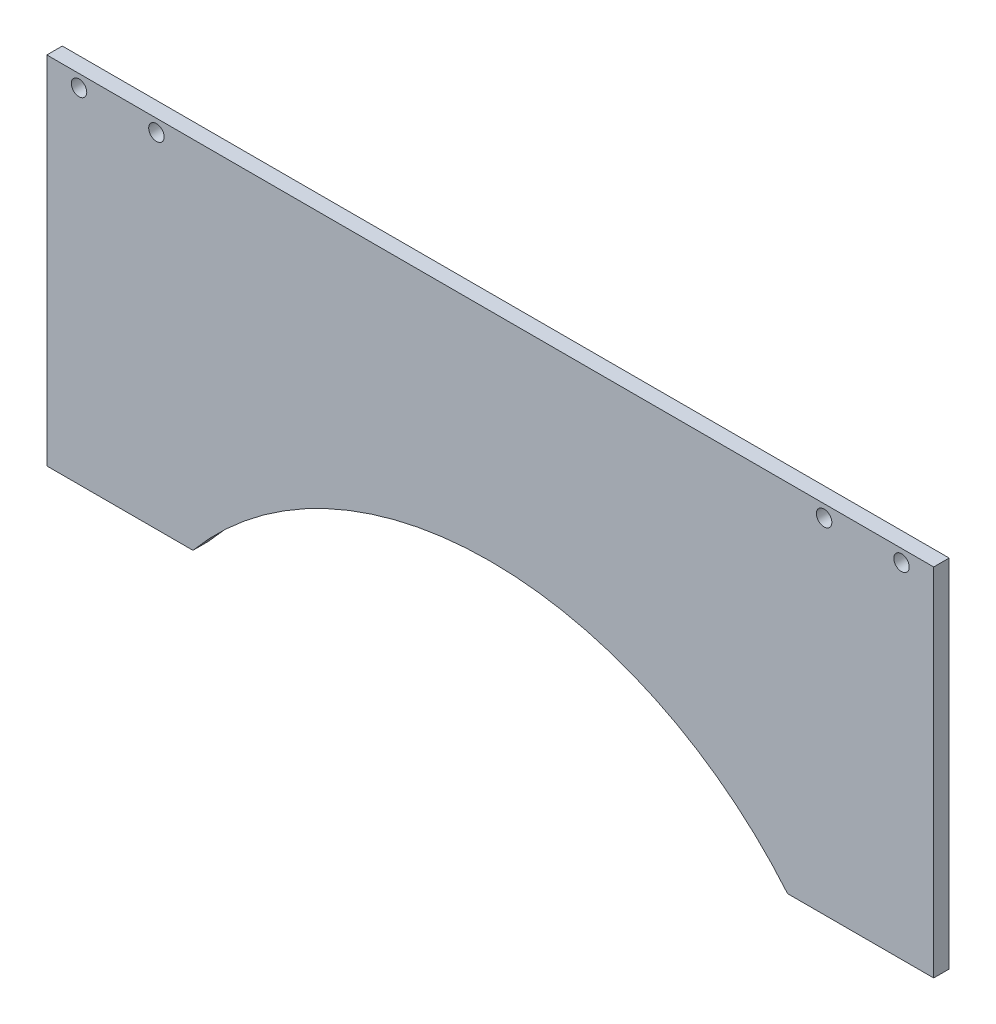
ISO-10303-21;
HEADER;
FILE_DESCRIPTION(('STEP AP214'),'2;1');
FILE_NAME('part.step','',(''),(''),'','','');
FILE_SCHEMA(('AUTOMOTIVE_DESIGN { 1 0 10303 214 1 1 1 1 }'));
ENDSEC;
DATA;
#1=APPLICATION_CONTEXT('core data for automotive mechanical design processes');
#2=APPLICATION_PROTOCOL_DEFINITION('international standard','automotive_design',2000,#1);
#3=PRODUCT_CONTEXT('',#1,'mechanical');
#4=PRODUCT('Part','Part','',(#3));
#5=PRODUCT_RELATED_PRODUCT_CATEGORY('part','',(#4));
#6=PRODUCT_DEFINITION_FORMATION('','',#4);
#7=PRODUCT_DEFINITION_CONTEXT('part definition',#1,'design');
#8=PRODUCT_DEFINITION('design','',#6,#7);
#9=PRODUCT_DEFINITION_SHAPE('','',#8);
#10=(LENGTH_UNIT() NAMED_UNIT(*) SI_UNIT(.MILLI.,.METRE.));
#11=(NAMED_UNIT(*) PLANE_ANGLE_UNIT() SI_UNIT($,.RADIAN.));
#12=(NAMED_UNIT(*) SI_UNIT($,.STERADIAN.) SOLID_ANGLE_UNIT());
#13=UNCERTAINTY_MEASURE_WITH_UNIT(LENGTH_MEASURE(1.E-05),#10,'distance_accuracy_value','');
#14=(GEOMETRIC_REPRESENTATION_CONTEXT(3) GLOBAL_UNCERTAINTY_ASSIGNED_CONTEXT((#13)) GLOBAL_UNIT_ASSIGNED_CONTEXT((#10,
#11,#12)) REPRESENTATION_CONTEXT('',''));
#15=CARTESIAN_POINT('',(0.,0.,0.));
#16=DIRECTION('',(0.,0.,1.));
#17=DIRECTION('',(1.,0.,0.));
#18=AXIS2_PLACEMENT_3D('',#15,#16,#17);
#19=CARTESIAN_POINT('',(-125.,0.,5.));
#20=DIRECTION('',(0.,1.,0.));
#21=DIRECTION('',(-1.,0.,0.));
#22=AXIS2_PLACEMENT_3D('',#19,#20,#21);
#23=PLANE('',#22);
#24=DIRECTION('',(1.,0.,0.));
#25=VECTOR('',#24,1.);
#26=CARTESIAN_POINT('',(-125.,0.,0.));
#27=LINE('',#26,#25);
#28=CARTESIAN_POINT('',(-125.,0.,0.));
#29=VERTEX_POINT('',#28);
#30=CARTESIAN_POINT('',(-77.7968635614927,0.,0.));
#31=VERTEX_POINT('',#30);
#32=EDGE_CURVE('E132',#29,#31,#27,.T.);
#33=ORIENTED_EDGE('',*,*,#32,.T.);
#34=DIRECTION('',(0.,0.,1.));
#35=VECTOR('',#34,1.);
#36=CARTESIAN_POINT('',(-77.7968635614927,0.,-5.));
#37=LINE('',#36,#35);
#38=CARTESIAN_POINT('',(-77.7968635614927,0.,5.));
#39=VERTEX_POINT('',#38);
#40=EDGE_CURVE('E56',#31,#39,#37,.T.);
#41=ORIENTED_EDGE('',*,*,#40,.T.);
#42=DIRECTION('',(1.,0.,0.));
#43=VECTOR('',#42,1.);
#44=CARTESIAN_POINT('',(-125.,0.,5.));
#45=LINE('',#44,#43);
#46=CARTESIAN_POINT('',(-125.,0.,5.));
#47=VERTEX_POINT('',#46);
#48=EDGE_CURVE('E92',#47,#39,#45,.T.);
#49=ORIENTED_EDGE('',*,*,#48,.F.);
#50=DIRECTION('',(0.,0.,-1.));
#51=VECTOR('',#50,1.);
#52=CARTESIAN_POINT('',(-125.,0.,5.));
#53=LINE('',#52,#51);
#54=EDGE_CURVE('E49',#47,#29,#53,.T.);
#55=ORIENTED_EDGE('',*,*,#54,.T.);
#56=EDGE_LOOP('',(#33,#41,#49,#55));
#57=FACE_BOUND('',#56,.T.);
#58=ADVANCED_FACE('F41',(#57),#23,.F.);
#59=CARTESIAN_POINT('',(-125.,115.,5.));
#60=DIRECTION('',(1.,0.,0.));
#61=DIRECTION('',(0.,1.,0.));
#62=AXIS2_PLACEMENT_3D('',#59,#60,#61);
#63=PLANE('',#62);
#64=DIRECTION('',(0.,-1.,0.));
#65=VECTOR('',#64,1.);
#66=CARTESIAN_POINT('',(-125.,115.,0.));
#67=LINE('',#66,#65);
#68=CARTESIAN_POINT('',(-125.,115.,0.));
#69=VERTEX_POINT('',#68);
#70=EDGE_CURVE('E127',#69,#29,#67,.T.);
#71=ORIENTED_EDGE('',*,*,#70,.T.);
#72=ORIENTED_EDGE('',*,*,#54,.F.);
#73=DIRECTION('',(0.,-1.,0.));
#74=VECTOR('',#73,1.);
#75=CARTESIAN_POINT('',(-125.,115.,5.));
#76=LINE('',#75,#74);
#77=CARTESIAN_POINT('',(-125.,115.,5.));
#78=VERTEX_POINT('',#77);
#79=EDGE_CURVE('E118',#78,#47,#76,.T.);
#80=ORIENTED_EDGE('',*,*,#79,.F.);
#81=DIRECTION('',(0.,0.,-1.));
#82=VECTOR('',#81,1.);
#83=CARTESIAN_POINT('',(-125.,115.,5.));
#84=LINE('',#83,#82);
#85=EDGE_CURVE('E126',#78,#69,#84,.T.);
#86=ORIENTED_EDGE('',*,*,#85,.T.);
#87=EDGE_LOOP('',(#71,#72,#80,#86));
#88=FACE_BOUND('',#87,.T.);
#89=ADVANCED_FACE('F43',(#88),#63,.F.);
#90=CARTESIAN_POINT('',(114.296863561493,0.,5.));
#91=VERTEX_POINT('',#90);
#92=CARTESIAN_POINT('',(161.5,0.,5.));
#93=VERTEX_POINT('',#92);
#94=EDGE_CURVE('E111',#91,#93,#45,.T.);
#95=ORIENTED_EDGE('',*,*,#94,.F.);
#96=DIRECTION('',(0.,0.,1.));
#97=VECTOR('',#96,1.);
#98=CARTESIAN_POINT('',(114.296863561493,0.,-5.));
#99=LINE('',#98,#97);
#100=CARTESIAN_POINT('',(114.296863561493,0.,0.));
#101=VERTEX_POINT('',#100);
#102=EDGE_CURVE('E101',#91,#101,#99,.F.);
#103=ORIENTED_EDGE('',*,*,#102,.T.);
#104=CARTESIAN_POINT('',(161.5,0.,0.));
#105=VERTEX_POINT('',#104);
#106=EDGE_CURVE('E130',#101,#105,#27,.T.);
#107=ORIENTED_EDGE('',*,*,#106,.T.);
#108=DIRECTION('',(0.,0.,-1.));
#109=VECTOR('',#108,1.);
#110=CARTESIAN_POINT('',(161.5,0.,5.));
#111=LINE('',#110,#109);
#112=EDGE_CURVE('E116',#93,#105,#111,.T.);
#113=ORIENTED_EDGE('',*,*,#112,.F.);
#114=EDGE_LOOP('',(#95,#103,#107,#113));
#115=FACE_BOUND('',#114,.T.);
#116=ADVANCED_FACE('F114',(#115),#23,.F.);
#117=CARTESIAN_POINT('',(161.5,115.,5.));
#118=DIRECTION('',(-1.,0.,0.));
#119=DIRECTION('',(0.,-1.,0.));
#120=AXIS2_PLACEMENT_3D('',#117,#118,#119);
#121=PLANE('',#120);
#122=DIRECTION('',(0.,1.,0.));
#123=VECTOR('',#122,1.);
#124=CARTESIAN_POINT('',(161.5,115.,0.));
#125=LINE('',#124,#123);
#126=CARTESIAN_POINT('',(161.5,115.,0.));
#127=VERTEX_POINT('',#126);
#128=EDGE_CURVE('E135',#105,#127,#125,.T.);
#129=ORIENTED_EDGE('',*,*,#128,.T.);
#130=DIRECTION('',(0.,0.,-1.));
#131=VECTOR('',#130,1.);
#132=CARTESIAN_POINT('',(161.5,115.,5.));
#133=LINE('',#132,#131);
#134=CARTESIAN_POINT('',(161.5,115.,5.));
#135=VERTEX_POINT('',#134);
#136=EDGE_CURVE('E139',#135,#127,#133,.T.);
#137=ORIENTED_EDGE('',*,*,#136,.F.);
#138=DIRECTION('',(0.,1.,0.));
#139=VECTOR('',#138,1.);
#140=CARTESIAN_POINT('',(161.5,115.,5.));
#141=LINE('',#140,#139);
#142=EDGE_CURVE('E120',#93,#135,#141,.T.);
#143=ORIENTED_EDGE('',*,*,#142,.F.);
#144=ORIENTED_EDGE('',*,*,#112,.T.);
#145=EDGE_LOOP('',(#129,#137,#143,#144));
#146=FACE_BOUND('',#145,.T.);
#147=ADVANCED_FACE('F179',(#146),#121,.F.);
#148=CARTESIAN_POINT('',(-125.,115.,5.));
#149=DIRECTION('',(0.,-1.,0.));
#150=DIRECTION('',(0.,0.,-1.));
#151=AXIS2_PLACEMENT_3D('',#148,#149,#150);
#152=PLANE('',#151);
#153=DIRECTION('',(-1.,0.,0.));
#154=VECTOR('',#153,1.);
#155=CARTESIAN_POINT('',(-125.,115.,0.));
#156=LINE('',#155,#154);
#157=EDGE_CURVE('E85',#127,#69,#156,.T.);
#158=ORIENTED_EDGE('',*,*,#157,.T.);
#159=ORIENTED_EDGE('',*,*,#85,.F.);
#160=DIRECTION('',(-1.,0.,0.));
#161=VECTOR('',#160,1.);
#162=CARTESIAN_POINT('',(-125.,115.,5.));
#163=LINE('',#162,#161);
#164=EDGE_CURVE('E64',#135,#78,#163,.T.);
#165=ORIENTED_EDGE('',*,*,#164,.F.);
#166=ORIENTED_EDGE('',*,*,#136,.T.);
#167=EDGE_LOOP('',(#158,#159,#165,#166));
#168=FACE_BOUND('',#167,.T.);
#169=ADVANCED_FACE('F184',(#168),#152,.F.);
#170=CARTESIAN_POINT('',(0.,0.,5.));
#171=DIRECTION('',(0.,0.,1.));
#172=DIRECTION('',(1.,0.,0.));
#173=AXIS2_PLACEMENT_3D('',#170,#171,#172);
#174=PLANE('',#173);
#175=CARTESIAN_POINT('',(18.25,-80.,5.));
#176=DIRECTION('',(0.,0.,1.));
#177=DIRECTION('',(1.,0.,0.));
#178=AXIS2_PLACEMENT_3D('',#175,#176,#177);
#179=CIRCLE('',#178,125.);
#180=EDGE_CURVE('E104',#91,#39,#179,.T.);
#181=ORIENTED_EDGE('',*,*,#180,.F.);
#182=ORIENTED_EDGE('',*,*,#94,.T.);
#183=ORIENTED_EDGE('',*,*,#142,.T.);
#184=ORIENTED_EDGE('',*,*,#164,.T.);
#185=ORIENTED_EDGE('',*,*,#79,.T.);
#186=ORIENTED_EDGE('',*,*,#48,.T.);
#187=EDGE_LOOP('',(#181,#182,#183,#184,#185,#186));
#188=FACE_BOUND('',#187,.T.);
#189=CARTESIAN_POINT('',(151.1,111.,5.));
#190=DIRECTION('',(0.,0.,1.));
#191=DIRECTION('',(1.,0.,0.));
#192=AXIS2_PLACEMENT_3D('',#189,#190,#191);
#193=CIRCLE('',#192,2.5);
#194=CARTESIAN_POINT('',(153.6,111.,5.));
#195=VERTEX_POINT('',#194);
#196=EDGE_CURVE('E147',#195,#195,#193,.T.);
#197=ORIENTED_EDGE('',*,*,#196,.F.);
#198=EDGE_LOOP('',(#197));
#199=FACE_BOUND('',#198,.T.);
#200=CARTESIAN_POINT('',(-89.6,111.,5.));
#201=DIRECTION('',(0.,0.,1.));
#202=DIRECTION('',(1.,0.,0.));
#203=AXIS2_PLACEMENT_3D('',#200,#201,#202);
#204=CIRCLE('',#203,2.5);
#205=CARTESIAN_POINT('',(-87.1,111.,5.));
#206=VERTEX_POINT('',#205);
#207=EDGE_CURVE('E214',#206,#206,#204,.T.);
#208=ORIENTED_EDGE('',*,*,#207,.F.);
#209=EDGE_LOOP('',(#208));
#210=FACE_BOUND('',#209,.T.);
#211=CARTESIAN_POINT('',(-114.6,111.,5.));
#212=DIRECTION('',(0.,0.,1.));
#213=DIRECTION('',(1.,0.,0.));
#214=AXIS2_PLACEMENT_3D('',#211,#212,#213);
#215=CIRCLE('',#214,2.5);
#216=CARTESIAN_POINT('',(-112.1,111.,5.));
#217=VERTEX_POINT('',#216);
#218=EDGE_CURVE('E217',#217,#217,#215,.T.);
#219=ORIENTED_EDGE('',*,*,#218,.F.);
#220=EDGE_LOOP('',(#219));
#221=FACE_BOUND('',#220,.T.);
#222=CARTESIAN_POINT('',(126.1,111.,5.));
#223=DIRECTION('',(0.,0.,1.));
#224=DIRECTION('',(1.,0.,0.));
#225=AXIS2_PLACEMENT_3D('',#222,#223,#224);
#226=CIRCLE('',#225,2.5);
#227=CARTESIAN_POINT('',(128.6,111.,5.));
#228=VERTEX_POINT('',#227);
#229=EDGE_CURVE('E205',#228,#228,#226,.T.);
#230=ORIENTED_EDGE('',*,*,#229,.F.);
#231=EDGE_LOOP('',(#230));
#232=FACE_BOUND('',#231,.T.);
#233=ADVANCED_FACE('F109',(#188,#199,#210,#221,#232),#174,.T.);
#234=CARTESIAN_POINT('',(0.,0.,0.));
#235=DIRECTION('',(0.,0.,1.));
#236=DIRECTION('',(1.,0.,0.));
#237=AXIS2_PLACEMENT_3D('',#234,#235,#236);
#238=PLANE('',#237);
#239=CARTESIAN_POINT('',(151.1,111.,0.));
#240=DIRECTION('',(0.,0.,1.));
#241=DIRECTION('',(1.,0.,0.));
#242=AXIS2_PLACEMENT_3D('',#239,#240,#241);
#243=CIRCLE('',#242,2.5);
#244=CARTESIAN_POINT('',(153.6,111.,0.));
#245=VERTEX_POINT('',#244);
#246=EDGE_CURVE('E131',#245,#245,#243,.T.);
#247=ORIENTED_EDGE('',*,*,#246,.T.);
#248=EDGE_LOOP('',(#247));
#249=FACE_BOUND('',#248,.T.);
#250=CARTESIAN_POINT('',(-89.6,111.,0.));
#251=DIRECTION('',(0.,0.,1.));
#252=DIRECTION('',(1.,0.,0.));
#253=AXIS2_PLACEMENT_3D('',#250,#251,#252);
#254=CIRCLE('',#253,2.5);
#255=CARTESIAN_POINT('',(-87.1,111.,0.));
#256=VERTEX_POINT('',#255);
#257=EDGE_CURVE('E150',#256,#256,#254,.T.);
#258=ORIENTED_EDGE('',*,*,#257,.T.);
#259=EDGE_LOOP('',(#258));
#260=FACE_BOUND('',#259,.T.);
#261=CARTESIAN_POINT('',(-114.6,111.,0.));
#262=DIRECTION('',(0.,0.,1.));
#263=DIRECTION('',(1.,0.,0.));
#264=AXIS2_PLACEMENT_3D('',#261,#262,#263);
#265=CIRCLE('',#264,2.5);
#266=CARTESIAN_POINT('',(-112.1,111.,0.));
#267=VERTEX_POINT('',#266);
#268=EDGE_CURVE('E146',#267,#267,#265,.T.);
#269=ORIENTED_EDGE('',*,*,#268,.T.);
#270=EDGE_LOOP('',(#269));
#271=FACE_BOUND('',#270,.T.);
#272=CARTESIAN_POINT('',(126.1,111.,0.));
#273=DIRECTION('',(0.,0.,1.));
#274=DIRECTION('',(1.,0.,0.));
#275=AXIS2_PLACEMENT_3D('',#272,#273,#274);
#276=CIRCLE('',#275,2.5);
#277=CARTESIAN_POINT('',(128.6,111.,0.));
#278=VERTEX_POINT('',#277);
#279=EDGE_CURVE('E143',#278,#278,#276,.T.);
#280=ORIENTED_EDGE('',*,*,#279,.T.);
#281=EDGE_LOOP('',(#280));
#282=FACE_BOUND('',#281,.T.);
#283=ORIENTED_EDGE('',*,*,#106,.F.);
#284=CARTESIAN_POINT('',(18.25,-80.,0.));
#285=DIRECTION('',(0.,0.,1.));
#286=DIRECTION('',(1.,0.,0.));
#287=AXIS2_PLACEMENT_3D('',#284,#285,#286);
#288=CIRCLE('',#287,125.);
#289=EDGE_CURVE('E11',#101,#31,#288,.T.);
#290=ORIENTED_EDGE('',*,*,#289,.T.);
#291=ORIENTED_EDGE('',*,*,#32,.F.);
#292=ORIENTED_EDGE('',*,*,#70,.F.);
#293=ORIENTED_EDGE('',*,*,#157,.F.);
#294=ORIENTED_EDGE('',*,*,#128,.F.);
#295=EDGE_LOOP('',(#283,#290,#291,#292,#293,#294));
#296=FACE_BOUND('',#295,.T.);
#297=ADVANCED_FACE('F155',(#249,#260,#271,#282,#296),#238,.F.);
#298=CARTESIAN_POINT('',(126.1,111.,-8.));
#299=DIRECTION('',(0.,0.,1.));
#300=DIRECTION('',(1.,0.,0.));
#301=AXIS2_PLACEMENT_3D('',#298,#299,#300);
#302=CYLINDRICAL_SURFACE('',#301,2.5);
#303=ORIENTED_EDGE('',*,*,#229,.T.);
#304=EDGE_LOOP('',(#303));
#305=FACE_BOUND('',#304,.T.);
#306=ORIENTED_EDGE('',*,*,#279,.F.);
#307=EDGE_LOOP('',(#306));
#308=FACE_BOUND('',#307,.T.);
#309=ADVANCED_FACE('F193',(#305,#308),#302,.F.);
#310=CARTESIAN_POINT('',(-114.6,111.,-8.));
#311=DIRECTION('',(0.,0.,1.));
#312=DIRECTION('',(1.,0.,0.));
#313=AXIS2_PLACEMENT_3D('',#310,#311,#312);
#314=CYLINDRICAL_SURFACE('',#313,2.5);
#315=ORIENTED_EDGE('',*,*,#218,.T.);
#316=EDGE_LOOP('',(#315));
#317=FACE_BOUND('',#316,.T.);
#318=ORIENTED_EDGE('',*,*,#268,.F.);
#319=EDGE_LOOP('',(#318));
#320=FACE_BOUND('',#319,.T.);
#321=ADVANCED_FACE('F169',(#317,#320),#314,.F.);
#322=CARTESIAN_POINT('',(-89.6,111.,-8.));
#323=DIRECTION('',(0.,0.,1.));
#324=DIRECTION('',(1.,0.,0.));
#325=AXIS2_PLACEMENT_3D('',#322,#323,#324);
#326=CYLINDRICAL_SURFACE('',#325,2.5);
#327=ORIENTED_EDGE('',*,*,#207,.T.);
#328=EDGE_LOOP('',(#327));
#329=FACE_BOUND('',#328,.T.);
#330=ORIENTED_EDGE('',*,*,#257,.F.);
#331=EDGE_LOOP('',(#330));
#332=FACE_BOUND('',#331,.T.);
#333=ADVANCED_FACE('F160',(#329,#332),#326,.F.);
#334=CARTESIAN_POINT('',(151.1,111.,-8.));
#335=DIRECTION('',(0.,0.,1.));
#336=DIRECTION('',(1.,0.,0.));
#337=AXIS2_PLACEMENT_3D('',#334,#335,#336);
#338=CYLINDRICAL_SURFACE('',#337,2.5);
#339=ORIENTED_EDGE('',*,*,#196,.T.);
#340=EDGE_LOOP('',(#339));
#341=FACE_BOUND('',#340,.T.);
#342=ORIENTED_EDGE('',*,*,#246,.F.);
#343=EDGE_LOOP('',(#342));
#344=FACE_BOUND('',#343,.T.);
#345=ADVANCED_FACE('F158',(#341,#344),#338,.F.);
#346=CARTESIAN_POINT('',(18.25,-80.,-5.));
#347=DIRECTION('',(0.,0.,1.));
#348=DIRECTION('',(1.,0.,0.));
#349=AXIS2_PLACEMENT_3D('',#346,#347,#348);
#350=CYLINDRICAL_SURFACE('',#349,125.);
#351=ORIENTED_EDGE('',*,*,#289,.F.);
#352=ORIENTED_EDGE('',*,*,#102,.F.);
#353=ORIENTED_EDGE('',*,*,#180,.T.);
#354=ORIENTED_EDGE('',*,*,#40,.F.);
#355=EDGE_LOOP('',(#351,#352,#353,#354));
#356=FACE_BOUND('',#355,.T.);
#357=ADVANCED_FACE('F103',(#356),#350,.F.);
#358=CLOSED_SHELL('',(#58,#89,#116,#147,#169,#233,#297,#309,#321,#333,#345,#357));
#359=MANIFOLD_SOLID_BREP('B2',#358);
#360=ADVANCED_BREP_SHAPE_REPRESENTATION('',(#18,#359),#14);
#361=SHAPE_DEFINITION_REPRESENTATION(#9,#360);
ENDSEC;
END-ISO-10303-21;
